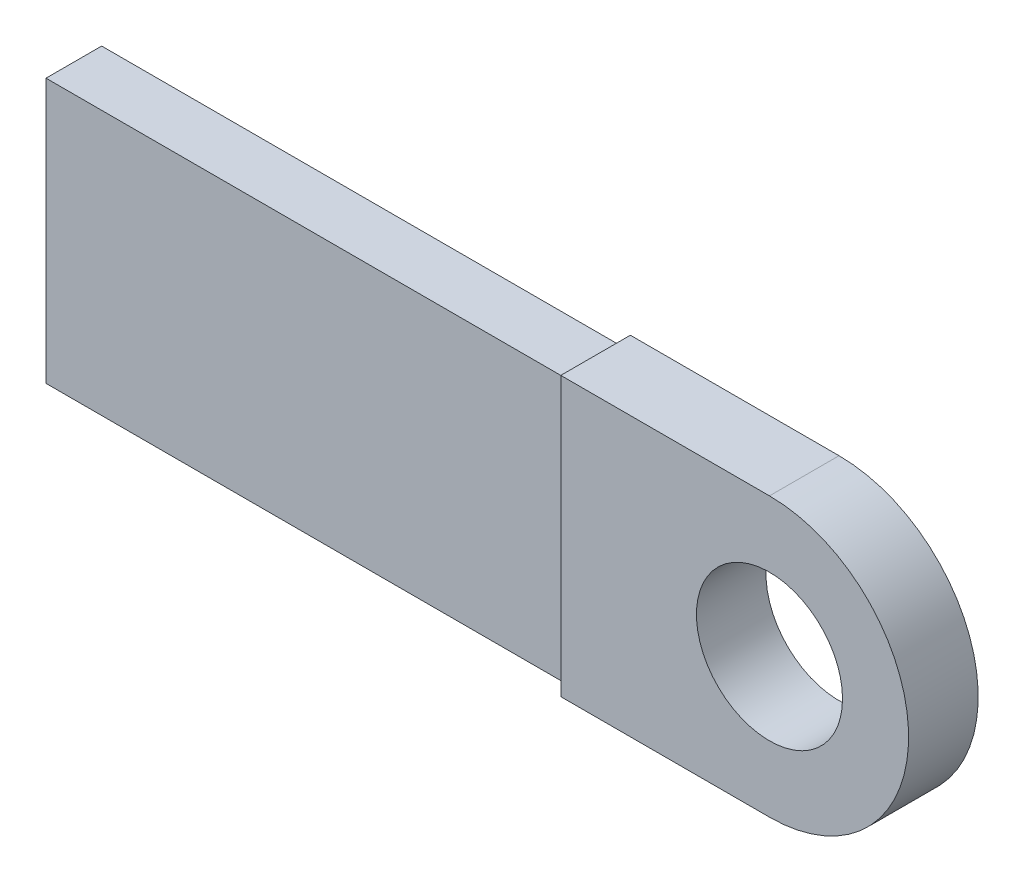
ISO-10303-21;
HEADER;
FILE_DESCRIPTION(('STEP AP214'),'2;1');
FILE_NAME('part.step','',(''),(''),'','','');
FILE_SCHEMA(('AUTOMOTIVE_DESIGN { 1 0 10303 214 1 1 1 1 }'));
ENDSEC;
DATA;
#1=APPLICATION_CONTEXT('core data for automotive mechanical design processes');
#2=APPLICATION_PROTOCOL_DEFINITION('international standard','automotive_design',2000,#1);
#3=PRODUCT_CONTEXT('',#1,'mechanical');
#4=PRODUCT('Part','Part','',(#3));
#5=PRODUCT_RELATED_PRODUCT_CATEGORY('part','',(#4));
#6=PRODUCT_DEFINITION_FORMATION('','',#4);
#7=PRODUCT_DEFINITION_CONTEXT('part definition',#1,'design');
#8=PRODUCT_DEFINITION('design','',#6,#7);
#9=PRODUCT_DEFINITION_SHAPE('','',#8);
#10=(LENGTH_UNIT() NAMED_UNIT(*) SI_UNIT(.MILLI.,.METRE.));
#11=(NAMED_UNIT(*) PLANE_ANGLE_UNIT() SI_UNIT($,.RADIAN.));
#12=(NAMED_UNIT(*) SI_UNIT($,.STERADIAN.) SOLID_ANGLE_UNIT());
#13=UNCERTAINTY_MEASURE_WITH_UNIT(LENGTH_MEASURE(1.E-05),#10,'distance_accuracy_value','');
#14=(GEOMETRIC_REPRESENTATION_CONTEXT(3) GLOBAL_UNCERTAINTY_ASSIGNED_CONTEXT((#13)) GLOBAL_UNIT_ASSIGNED_CONTEXT((#10,
#11,#12)) REPRESENTATION_CONTEXT('',''));
#15=CARTESIAN_POINT('',(0.,0.,0.));
#16=DIRECTION('',(0.,0.,1.));
#17=DIRECTION('',(1.,0.,0.));
#18=AXIS2_PLACEMENT_3D('',#15,#16,#17);
#19=CARTESIAN_POINT('',(0.,0.,20.));
#20=DIRECTION('',(-1.,0.,0.));
#21=DIRECTION('',(0.,0.,1.));
#22=AXIS2_PLACEMENT_3D('',#19,#20,#21);
#23=PLANE('',#22);
#24=DIRECTION('',(0.,1.,0.));
#25=VECTOR('',#24,1.);
#26=CARTESIAN_POINT('',(0.,0.,0.));
#27=LINE('',#26,#25);
#28=CARTESIAN_POINT('',(0.,0.,0.));
#29=VERTEX_POINT('',#28);
#30=CARTESIAN_POINT('',(0.,80.,0.));
#31=VERTEX_POINT('',#30);
#32=EDGE_CURVE('E156',#29,#31,#27,.T.);
#33=ORIENTED_EDGE('',*,*,#32,.F.);
#34=DIRECTION('',(0.,0.,-1.));
#35=VECTOR('',#34,1.);
#36=CARTESIAN_POINT('',(0.,0.,20.));
#37=LINE('',#36,#35);
#38=CARTESIAN_POINT('',(0.,0.,20.));
#39=VERTEX_POINT('',#38);
#40=EDGE_CURVE('E161',#39,#29,#37,.T.);
#41=ORIENTED_EDGE('',*,*,#40,.F.);
#42=DIRECTION('',(0.,1.,0.));
#43=VECTOR('',#42,1.);
#44=CARTESIAN_POINT('',(0.,0.,20.));
#45=LINE('',#44,#43);
#46=CARTESIAN_POINT('',(0.,80.,20.));
#47=VERTEX_POINT('',#46);
#48=EDGE_CURVE('E147',#39,#47,#45,.T.);
#49=ORIENTED_EDGE('',*,*,#48,.T.);
#50=DIRECTION('',(0.,0.,-1.));
#51=VECTOR('',#50,1.);
#52=CARTESIAN_POINT('',(0.,80.,20.));
#53=LINE('',#52,#51);
#54=EDGE_CURVE('E42',#47,#31,#53,.T.);
#55=ORIENTED_EDGE('',*,*,#54,.T.);
#56=EDGE_LOOP('',(#33,#41,#49,#55));
#57=FACE_BOUND('',#56,.T.);
#58=DIRECTION('',(0.,-1.,0.));
#59=VECTOR('',#58,1.);
#60=CARTESIAN_POINT('',(0.,78.,2.));
#61=LINE('',#60,#59);
#62=CARTESIAN_POINT('',(0.,78.,2.));
#63=VERTEX_POINT('',#62);
#64=CARTESIAN_POINT('',(0.,2.,2.));
#65=VERTEX_POINT('',#64);
#66=EDGE_CURVE('E282',#63,#65,#61,.T.);
#67=ORIENTED_EDGE('',*,*,#66,.F.);
#68=DIRECTION('',(0.,0.,-1.));
#69=VECTOR('',#68,1.);
#70=CARTESIAN_POINT('',(0.,78.,18.));
#71=LINE('',#70,#69);
#72=CARTESIAN_POINT('',(0.,78.,18.));
#73=VERTEX_POINT('',#72);
#74=EDGE_CURVE('E128',#73,#63,#71,.T.);
#75=ORIENTED_EDGE('',*,*,#74,.F.);
#76=DIRECTION('',(0.,1.,0.));
#77=VECTOR('',#76,1.);
#78=CARTESIAN_POINT('',(0.,2.,18.));
#79=LINE('',#78,#77);
#80=CARTESIAN_POINT('',(0.,2.,18.));
#81=VERTEX_POINT('',#80);
#82=EDGE_CURVE('E124',#81,#73,#79,.T.);
#83=ORIENTED_EDGE('',*,*,#82,.F.);
#84=DIRECTION('',(0.,0.,1.));
#85=VECTOR('',#84,1.);
#86=CARTESIAN_POINT('',(0.,2.,2.));
#87=LINE('',#86,#85);
#88=EDGE_CURVE('E279',#65,#81,#87,.T.);
#89=ORIENTED_EDGE('',*,*,#88,.F.);
#90=EDGE_LOOP('',(#67,#75,#83,#89));
#91=FACE_BOUND('',#90,.T.);
#92=ADVANCED_FACE('F34',(#57,#91),#23,.T.);
#93=CARTESIAN_POINT('',(60.,40.,20.));
#94=DIRECTION('',(0.,0.,-1.));
#95=DIRECTION('',(-1.,0.,0.));
#96=AXIS2_PLACEMENT_3D('',#93,#94,#95);
#97=CYLINDRICAL_SURFACE('',#96,40.);
#98=CARTESIAN_POINT('',(60.,40.,0.));
#99=DIRECTION('',(0.,0.,1.));
#100=DIRECTION('',(1.,0.,0.));
#101=AXIS2_PLACEMENT_3D('',#98,#99,#100);
#102=CIRCLE('',#101,40.);
#103=CARTESIAN_POINT('',(60.,80.,0.));
#104=VERTEX_POINT('',#103);
#105=CARTESIAN_POINT('',(60.,0.,0.));
#106=VERTEX_POINT('',#105);
#107=EDGE_CURVE('E139',#104,#106,#102,.F.);
#108=ORIENTED_EDGE('',*,*,#107,.F.);
#109=DIRECTION('',(0.,0.,-1.));
#110=VECTOR('',#109,1.);
#111=CARTESIAN_POINT('',(60.,80.,20.));
#112=LINE('',#111,#110);
#113=CARTESIAN_POINT('',(60.,80.,20.));
#114=VERTEX_POINT('',#113);
#115=EDGE_CURVE('E11',#114,#104,#112,.T.);
#116=ORIENTED_EDGE('',*,*,#115,.F.);
#117=CARTESIAN_POINT('',(60.,40.,20.));
#118=DIRECTION('',(0.,0.,1.));
#119=DIRECTION('',(1.,0.,0.));
#120=AXIS2_PLACEMENT_3D('',#117,#118,#119);
#121=CIRCLE('',#120,40.);
#122=CARTESIAN_POINT('',(60.,0.,20.));
#123=VERTEX_POINT('',#122);
#124=EDGE_CURVE('E141',#114,#123,#121,.F.);
#125=ORIENTED_EDGE('',*,*,#124,.T.);
#126=DIRECTION('',(0.,0.,-1.));
#127=VECTOR('',#126,1.);
#128=CARTESIAN_POINT('',(60.,0.,20.));
#129=LINE('',#128,#127);
#130=EDGE_CURVE('E79',#123,#106,#129,.T.);
#131=ORIENTED_EDGE('',*,*,#130,.T.);
#132=EDGE_LOOP('',(#108,#116,#125,#131));
#133=FACE_BOUND('',#132,.T.);
#134=ADVANCED_FACE('F36',(#133),#97,.T.);
#135=CARTESIAN_POINT('',(0.,80.,20.));
#136=DIRECTION('',(0.,1.,0.));
#137=DIRECTION('',(0.,0.,1.));
#138=AXIS2_PLACEMENT_3D('',#135,#136,#137);
#139=PLANE('',#138);
#140=DIRECTION('',(1.,0.,0.));
#141=VECTOR('',#140,1.);
#142=CARTESIAN_POINT('',(0.,80.,0.));
#143=LINE('',#142,#141);
#144=EDGE_CURVE('E153',#31,#104,#143,.T.);
#145=ORIENTED_EDGE('',*,*,#144,.F.);
#146=ORIENTED_EDGE('',*,*,#54,.F.);
#147=DIRECTION('',(1.,0.,0.));
#148=VECTOR('',#147,1.);
#149=CARTESIAN_POINT('',(0.,80.,20.));
#150=LINE('',#149,#148);
#151=EDGE_CURVE('E143',#47,#114,#150,.T.);
#152=ORIENTED_EDGE('',*,*,#151,.T.);
#153=ORIENTED_EDGE('',*,*,#115,.T.);
#154=EDGE_LOOP('',(#145,#146,#152,#153));
#155=FACE_BOUND('',#154,.T.);
#156=ADVANCED_FACE('F168',(#155),#139,.T.);
#157=CARTESIAN_POINT('',(0.,0.,20.));
#158=DIRECTION('',(0.,1.,0.));
#159=DIRECTION('',(0.,0.,1.));
#160=AXIS2_PLACEMENT_3D('',#157,#158,#159);
#161=PLANE('',#160);
#162=DIRECTION('',(1.,0.,0.));
#163=VECTOR('',#162,1.);
#164=CARTESIAN_POINT('',(0.,0.,0.));
#165=LINE('',#164,#163);
#166=EDGE_CURVE('E144',#29,#106,#165,.T.);
#167=ORIENTED_EDGE('',*,*,#166,.T.);
#168=ORIENTED_EDGE('',*,*,#130,.F.);
#169=DIRECTION('',(1.,0.,0.));
#170=VECTOR('',#169,1.);
#171=CARTESIAN_POINT('',(0.,0.,20.));
#172=LINE('',#171,#170);
#173=EDGE_CURVE('E58',#39,#123,#172,.T.);
#174=ORIENTED_EDGE('',*,*,#173,.F.);
#175=ORIENTED_EDGE('',*,*,#40,.T.);
#176=EDGE_LOOP('',(#167,#168,#174,#175));
#177=FACE_BOUND('',#176,.T.);
#178=ADVANCED_FACE('F173',(#177),#161,.F.);
#179=CARTESIAN_POINT('',(0.,0.,20.));
#180=DIRECTION('',(0.,0.,1.));
#181=DIRECTION('',(1.,0.,0.));
#182=AXIS2_PLACEMENT_3D('',#179,#180,#181);
#183=PLANE('',#182);
#184=CARTESIAN_POINT('',(60.,40.,20.));
#185=DIRECTION('',(0.,0.,1.));
#186=DIRECTION('',(1.,0.,0.));
#187=AXIS2_PLACEMENT_3D('',#184,#185,#186);
#188=CIRCLE('',#187,21.);
#189=CARTESIAN_POINT('',(81.,40.,20.));
#190=VERTEX_POINT('',#189);
#191=EDGE_CURVE('E130',#190,#190,#188,.T.);
#192=ORIENTED_EDGE('',*,*,#191,.F.);
#193=EDGE_LOOP('',(#192));
#194=FACE_BOUND('',#193,.T.);
#195=ORIENTED_EDGE('',*,*,#124,.F.);
#196=ORIENTED_EDGE('',*,*,#151,.F.);
#197=ORIENTED_EDGE('',*,*,#48,.F.);
#198=ORIENTED_EDGE('',*,*,#173,.T.);
#199=EDGE_LOOP('',(#195,#196,#197,#198));
#200=FACE_BOUND('',#199,.T.);
#201=ADVANCED_FACE('F174',(#194,#200),#183,.T.);
#202=CARTESIAN_POINT('',(0.,0.,0.));
#203=DIRECTION('',(0.,0.,1.));
#204=DIRECTION('',(1.,0.,0.));
#205=AXIS2_PLACEMENT_3D('',#202,#203,#204);
#206=PLANE('',#205);
#207=CARTESIAN_POINT('',(60.,40.,0.));
#208=DIRECTION('',(0.,0.,1.));
#209=DIRECTION('',(1.,0.,0.));
#210=AXIS2_PLACEMENT_3D('',#207,#208,#209);
#211=CIRCLE('',#210,21.);
#212=CARTESIAN_POINT('',(81.,40.,0.));
#213=VERTEX_POINT('',#212);
#214=EDGE_CURVE('E133',#213,#213,#211,.T.);
#215=ORIENTED_EDGE('',*,*,#214,.T.);
#216=EDGE_LOOP('',(#215));
#217=FACE_BOUND('',#216,.T.);
#218=ORIENTED_EDGE('',*,*,#107,.T.);
#219=ORIENTED_EDGE('',*,*,#166,.F.);
#220=ORIENTED_EDGE('',*,*,#32,.T.);
#221=ORIENTED_EDGE('',*,*,#144,.T.);
#222=EDGE_LOOP('',(#218,#219,#220,#221));
#223=FACE_BOUND('',#222,.T.);
#224=ADVANCED_FACE('F171',(#217,#223),#206,.F.);
#225=CARTESIAN_POINT('',(60.,40.,0.));
#226=DIRECTION('',(0.,0.,1.));
#227=DIRECTION('',(1.,0.,0.));
#228=AXIS2_PLACEMENT_3D('',#225,#226,#227);
#229=CYLINDRICAL_SURFACE('',#228,21.);
#230=ORIENTED_EDGE('',*,*,#214,.F.);
#231=EDGE_LOOP('',(#230));
#232=FACE_BOUND('',#231,.T.);
#233=ORIENTED_EDGE('',*,*,#191,.T.);
#234=EDGE_LOOP('',(#233));
#235=FACE_BOUND('',#234,.T.);
#236=ADVANCED_FACE('F188',(#232,#235),#229,.F.);
#237=CARTESIAN_POINT('',(-150.,78.,18.));
#238=DIRECTION('',(0.,-1.,0.));
#239=DIRECTION('',(0.,0.,-1.));
#240=AXIS2_PLACEMENT_3D('',#237,#238,#239);
#241=PLANE('',#240);
#242=ORIENTED_EDGE('',*,*,#74,.T.);
#243=DIRECTION('',(1.,0.,0.));
#244=VECTOR('',#243,1.);
#245=CARTESIAN_POINT('',(-150.,78.,2.));
#246=LINE('',#245,#244);
#247=CARTESIAN_POINT('',(-150.,78.,2.));
#248=VERTEX_POINT('',#247);
#249=EDGE_CURVE('E109',#248,#63,#246,.T.);
#250=ORIENTED_EDGE('',*,*,#249,.F.);
#251=DIRECTION('',(0.,0.,-1.));
#252=VECTOR('',#251,1.);
#253=CARTESIAN_POINT('',(-150.,78.,18.));
#254=LINE('',#253,#252);
#255=CARTESIAN_POINT('',(-150.,78.,18.));
#256=VERTEX_POINT('',#255);
#257=EDGE_CURVE('E116',#256,#248,#254,.T.);
#258=ORIENTED_EDGE('',*,*,#257,.F.);
#259=DIRECTION('',(1.,0.,0.));
#260=VECTOR('',#259,1.);
#261=CARTESIAN_POINT('',(-150.,78.,18.));
#262=LINE('',#261,#260);
#263=EDGE_CURVE('E277',#256,#73,#262,.T.);
#264=ORIENTED_EDGE('',*,*,#263,.T.);
#265=EDGE_LOOP('',(#242,#250,#258,#264));
#266=FACE_BOUND('',#265,.T.);
#267=ADVANCED_FACE('F126',(#266),#241,.F.);
#268=CARTESIAN_POINT('',(-150.,78.,2.));
#269=DIRECTION('',(0.,0.,1.));
#270=DIRECTION('',(1.,0.,0.));
#271=AXIS2_PLACEMENT_3D('',#268,#269,#270);
#272=PLANE('',#271);
#273=ORIENTED_EDGE('',*,*,#66,.T.);
#274=DIRECTION('',(1.,0.,0.));
#275=VECTOR('',#274,1.);
#276=CARTESIAN_POINT('',(-150.,2.,2.));
#277=LINE('',#276,#275);
#278=CARTESIAN_POINT('',(-150.,2.,2.));
#279=VERTEX_POINT('',#278);
#280=EDGE_CURVE('E112',#279,#65,#277,.T.);
#281=ORIENTED_EDGE('',*,*,#280,.F.);
#282=DIRECTION('',(0.,-1.,0.));
#283=VECTOR('',#282,1.);
#284=CARTESIAN_POINT('',(-150.,78.,2.));
#285=LINE('',#284,#283);
#286=EDGE_CURVE('E105',#248,#279,#285,.T.);
#287=ORIENTED_EDGE('',*,*,#286,.F.);
#288=ORIENTED_EDGE('',*,*,#249,.T.);
#289=EDGE_LOOP('',(#273,#281,#287,#288));
#290=FACE_BOUND('',#289,.T.);
#291=ADVANCED_FACE('F107',(#290),#272,.F.);
#292=CARTESIAN_POINT('',(-150.,2.,2.));
#293=DIRECTION('',(0.,1.,0.));
#294=DIRECTION('',(0.,0.,1.));
#295=AXIS2_PLACEMENT_3D('',#292,#293,#294);
#296=PLANE('',#295);
#297=ORIENTED_EDGE('',*,*,#88,.T.);
#298=DIRECTION('',(1.,0.,0.));
#299=VECTOR('',#298,1.);
#300=CARTESIAN_POINT('',(-150.,2.,18.));
#301=LINE('',#300,#299);
#302=CARTESIAN_POINT('',(-150.,2.,18.));
#303=VERTEX_POINT('',#302);
#304=EDGE_CURVE('E49',#303,#81,#301,.T.);
#305=ORIENTED_EDGE('',*,*,#304,.F.);
#306=DIRECTION('',(0.,0.,1.));
#307=VECTOR('',#306,1.);
#308=CARTESIAN_POINT('',(-150.,2.,2.));
#309=LINE('',#308,#307);
#310=EDGE_CURVE('E115',#279,#303,#309,.T.);
#311=ORIENTED_EDGE('',*,*,#310,.F.);
#312=ORIENTED_EDGE('',*,*,#280,.T.);
#313=EDGE_LOOP('',(#297,#305,#311,#312));
#314=FACE_BOUND('',#313,.T.);
#315=ADVANCED_FACE('F200',(#314),#296,.F.);
#316=CARTESIAN_POINT('',(-150.,2.,18.));
#317=DIRECTION('',(0.,0.,-1.));
#318=DIRECTION('',(-1.,0.,0.));
#319=AXIS2_PLACEMENT_3D('',#316,#317,#318);
#320=PLANE('',#319);
#321=ORIENTED_EDGE('',*,*,#82,.T.);
#322=ORIENTED_EDGE('',*,*,#263,.F.);
#323=DIRECTION('',(0.,1.,0.));
#324=VECTOR('',#323,1.);
#325=CARTESIAN_POINT('',(-150.,2.,18.));
#326=LINE('',#325,#324);
#327=EDGE_CURVE('E120',#303,#256,#326,.T.);
#328=ORIENTED_EDGE('',*,*,#327,.F.);
#329=ORIENTED_EDGE('',*,*,#304,.T.);
#330=EDGE_LOOP('',(#321,#322,#328,#329));
#331=FACE_BOUND('',#330,.T.);
#332=ADVANCED_FACE('F203',(#331),#320,.F.);
#333=CARTESIAN_POINT('',(-150.,0.,0.));
#334=DIRECTION('',(-1.,0.,0.));
#335=DIRECTION('',(0.,0.,1.));
#336=AXIS2_PLACEMENT_3D('',#333,#334,#335);
#337=PLANE('',#336);
#338=ORIENTED_EDGE('',*,*,#257,.T.);
#339=ORIENTED_EDGE('',*,*,#286,.T.);
#340=ORIENTED_EDGE('',*,*,#310,.T.);
#341=ORIENTED_EDGE('',*,*,#327,.T.);
#342=EDGE_LOOP('',(#338,#339,#340,#341));
#343=FACE_BOUND('',#342,.T.);
#344=ADVANCED_FACE('F119',(#343),#337,.T.);
#345=CLOSED_SHELL('',(#92,#134,#156,#178,#201,#224,#236,#267,#291,#315,#332,#344));
#346=MANIFOLD_SOLID_BREP('B2',#345);
#347=ADVANCED_BREP_SHAPE_REPRESENTATION('',(#18,#346),#14);
#348=SHAPE_DEFINITION_REPRESENTATION(#9,#347);
ENDSEC;
END-ISO-10303-21;
